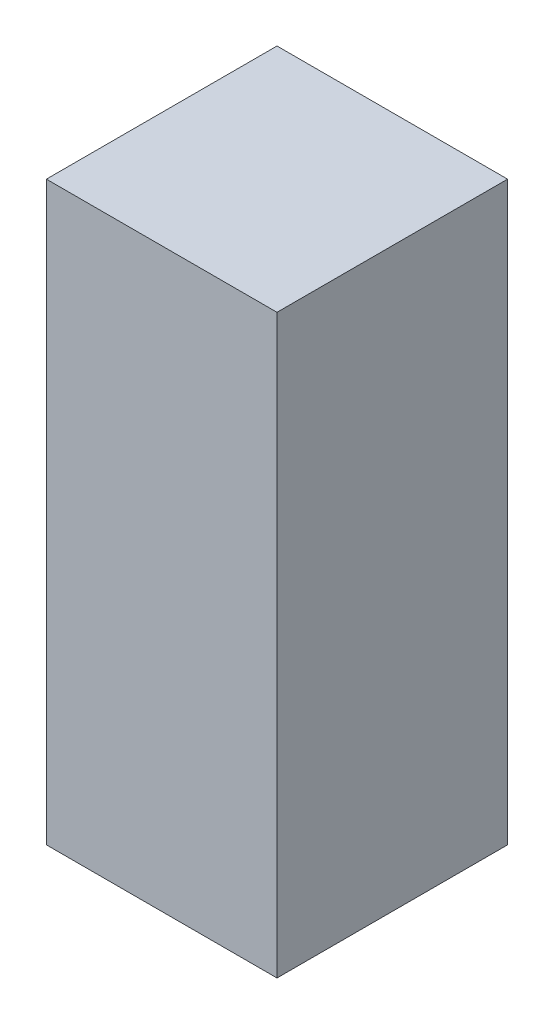
ISO-10303-21;
HEADER;
FILE_DESCRIPTION(('STEP AP214'),'2;1');
FILE_NAME('part.step','',(''),(''),'','','');
FILE_SCHEMA(('AUTOMOTIVE_DESIGN { 1 0 10303 214 1 1 1 1 }'));
ENDSEC;
DATA;
#1=APPLICATION_CONTEXT('core data for automotive mechanical design processes');
#2=APPLICATION_PROTOCOL_DEFINITION('international standard','automotive_design',2000,#1);
#3=PRODUCT_CONTEXT('',#1,'mechanical');
#4=PRODUCT('Part','Part','',(#3));
#5=PRODUCT_RELATED_PRODUCT_CATEGORY('part','',(#4));
#6=PRODUCT_DEFINITION_FORMATION('','',#4);
#7=PRODUCT_DEFINITION_CONTEXT('part definition',#1,'design');
#8=PRODUCT_DEFINITION('design','',#6,#7);
#9=PRODUCT_DEFINITION_SHAPE('','',#8);
#10=(LENGTH_UNIT() NAMED_UNIT(*) SI_UNIT(.MILLI.,.METRE.));
#11=(NAMED_UNIT(*) PLANE_ANGLE_UNIT() SI_UNIT($,.RADIAN.));
#12=(NAMED_UNIT(*) SI_UNIT($,.STERADIAN.) SOLID_ANGLE_UNIT());
#13=UNCERTAINTY_MEASURE_WITH_UNIT(LENGTH_MEASURE(1.E-05),#10,'distance_accuracy_value','');
#14=(GEOMETRIC_REPRESENTATION_CONTEXT(3) GLOBAL_UNCERTAINTY_ASSIGNED_CONTEXT((#13)) GLOBAL_UNIT_ASSIGNED_CONTEXT((#10,
#11,#12)) REPRESENTATION_CONTEXT('',''));
#15=CARTESIAN_POINT('',(0.,0.,0.));
#16=DIRECTION('',(0.,0.,1.));
#17=DIRECTION('',(1.,0.,0.));
#18=AXIS2_PLACEMENT_3D('',#15,#16,#17);
#19=CARTESIAN_POINT('',(0.,50.8,0.));
#20=DIRECTION('',(1.,0.,0.));
#21=DIRECTION('',(0.,0.,-1.));
#22=AXIS2_PLACEMENT_3D('',#19,#20,#21);
#23=PLANE('',#22);
#24=DIRECTION('',(0.,0.,1.));
#25=VECTOR('',#24,1.);
#26=CARTESIAN_POINT('',(0.,0.,0.));
#27=LINE('',#26,#25);
#28=CARTESIAN_POINT('',(0.,0.,-20.32));
#29=VERTEX_POINT('',#28);
#30=CARTESIAN_POINT('',(0.,0.,0.));
#31=VERTEX_POINT('',#30);
#32=EDGE_CURVE('E96',#29,#31,#27,.T.);
#33=ORIENTED_EDGE('',*,*,#32,.T.);
#34=DIRECTION('',(0.,-1.,0.));
#35=VECTOR('',#34,1.);
#36=CARTESIAN_POINT('',(0.,50.8,0.));
#37=LINE('',#36,#35);
#38=CARTESIAN_POINT('',(0.,50.8,0.));
#39=VERTEX_POINT('',#38);
#40=EDGE_CURVE('E11',#39,#31,#37,.T.);
#41=ORIENTED_EDGE('',*,*,#40,.F.);
#42=DIRECTION('',(0.,0.,1.));
#43=VECTOR('',#42,1.);
#44=CARTESIAN_POINT('',(0.,50.8,0.));
#45=LINE('',#44,#43);
#46=CARTESIAN_POINT('',(0.,50.8,-20.32));
#47=VERTEX_POINT('',#46);
#48=EDGE_CURVE('E84',#47,#39,#45,.T.);
#49=ORIENTED_EDGE('',*,*,#48,.F.);
#50=DIRECTION('',(0.,-1.,0.));
#51=VECTOR('',#50,1.);
#52=CARTESIAN_POINT('',(0.,50.8,-20.32));
#53=LINE('',#52,#51);
#54=EDGE_CURVE('E92',#47,#29,#53,.T.);
#55=ORIENTED_EDGE('',*,*,#54,.T.);
#56=EDGE_LOOP('',(#33,#41,#49,#55));
#57=FACE_BOUND('',#56,.T.);
#58=ADVANCED_FACE('F33',(#57),#23,.F.);
#59=CARTESIAN_POINT('',(0.,50.8,0.));
#60=DIRECTION('',(0.,0.,-1.));
#61=DIRECTION('',(-1.,0.,0.));
#62=AXIS2_PLACEMENT_3D('',#59,#60,#61);
#63=PLANE('',#62);
#64=DIRECTION('',(1.,0.,0.));
#65=VECTOR('',#64,1.);
#66=CARTESIAN_POINT('',(0.,0.,0.));
#67=LINE('',#66,#65);
#68=CARTESIAN_POINT('',(20.32,0.,0.));
#69=VERTEX_POINT('',#68);
#70=EDGE_CURVE('E88',#31,#69,#67,.T.);
#71=ORIENTED_EDGE('',*,*,#70,.T.);
#72=DIRECTION('',(0.,-1.,0.));
#73=VECTOR('',#72,1.);
#74=CARTESIAN_POINT('',(20.32,50.8,0.));
#75=LINE('',#74,#73);
#76=CARTESIAN_POINT('',(20.32,50.8,0.));
#77=VERTEX_POINT('',#76);
#78=EDGE_CURVE('E41',#77,#69,#75,.T.);
#79=ORIENTED_EDGE('',*,*,#78,.F.);
#80=DIRECTION('',(1.,0.,0.));
#81=VECTOR('',#80,1.);
#82=CARTESIAN_POINT('',(0.,50.8,0.));
#83=LINE('',#82,#81);
#84=EDGE_CURVE('E79',#39,#77,#83,.T.);
#85=ORIENTED_EDGE('',*,*,#84,.F.);
#86=ORIENTED_EDGE('',*,*,#40,.T.);
#87=EDGE_LOOP('',(#71,#79,#85,#86));
#88=FACE_BOUND('',#87,.T.);
#89=ADVANCED_FACE('F87',(#88),#63,.F.);
#90=CARTESIAN_POINT('',(20.32,50.8,0.));
#91=DIRECTION('',(-1.,0.,0.));
#92=DIRECTION('',(0.,0.,1.));
#93=AXIS2_PLACEMENT_3D('',#90,#91,#92);
#94=PLANE('',#93);
#95=DIRECTION('',(0.,0.,-1.));
#96=VECTOR('',#95,1.);
#97=CARTESIAN_POINT('',(20.32,0.,0.));
#98=LINE('',#97,#96);
#99=CARTESIAN_POINT('',(20.32,0.,-20.32));
#100=VERTEX_POINT('',#99);
#101=EDGE_CURVE('E66',#69,#100,#98,.T.);
#102=ORIENTED_EDGE('',*,*,#101,.T.);
#103=DIRECTION('',(0.,-1.,0.));
#104=VECTOR('',#103,1.);
#105=CARTESIAN_POINT('',(20.32,50.8,-20.32));
#106=LINE('',#105,#104);
#107=CARTESIAN_POINT('',(20.32,50.8,-20.32));
#108=VERTEX_POINT('',#107);
#109=EDGE_CURVE('E89',#108,#100,#106,.T.);
#110=ORIENTED_EDGE('',*,*,#109,.F.);
#111=DIRECTION('',(0.,0.,-1.));
#112=VECTOR('',#111,1.);
#113=CARTESIAN_POINT('',(20.32,50.8,0.));
#114=LINE('',#113,#112);
#115=EDGE_CURVE('E82',#77,#108,#114,.T.);
#116=ORIENTED_EDGE('',*,*,#115,.F.);
#117=ORIENTED_EDGE('',*,*,#78,.T.);
#118=EDGE_LOOP('',(#102,#110,#116,#117));
#119=FACE_BOUND('',#118,.T.);
#120=ADVANCED_FACE('F90',(#119),#94,.F.);
#121=CARTESIAN_POINT('',(0.,50.8,-20.32));
#122=DIRECTION('',(0.,0.,1.));
#123=DIRECTION('',(1.,0.,0.));
#124=AXIS2_PLACEMENT_3D('',#121,#122,#123);
#125=PLANE('',#124);
#126=DIRECTION('',(-1.,0.,0.));
#127=VECTOR('',#126,1.);
#128=CARTESIAN_POINT('',(0.,0.,-20.32));
#129=LINE('',#128,#127);
#130=EDGE_CURVE('E72',#100,#29,#129,.T.);
#131=ORIENTED_EDGE('',*,*,#130,.T.);
#132=ORIENTED_EDGE('',*,*,#54,.F.);
#133=DIRECTION('',(-1.,0.,0.));
#134=VECTOR('',#133,1.);
#135=CARTESIAN_POINT('',(0.,50.8,-20.32));
#136=LINE('',#135,#134);
#137=EDGE_CURVE('E49',#108,#47,#136,.T.);
#138=ORIENTED_EDGE('',*,*,#137,.F.);
#139=ORIENTED_EDGE('',*,*,#109,.T.);
#140=EDGE_LOOP('',(#131,#132,#138,#139));
#141=FACE_BOUND('',#140,.T.);
#142=ADVANCED_FACE('F103',(#141),#125,.F.);
#143=CARTESIAN_POINT('',(0.,50.8,0.));
#144=DIRECTION('',(0.,-1.,0.));
#145=DIRECTION('',(0.,0.,-1.));
#146=AXIS2_PLACEMENT_3D('',#143,#144,#145);
#147=PLANE('',#146);
#148=ORIENTED_EDGE('',*,*,#48,.T.);
#149=ORIENTED_EDGE('',*,*,#84,.T.);
#150=ORIENTED_EDGE('',*,*,#115,.T.);
#151=ORIENTED_EDGE('',*,*,#137,.T.);
#152=EDGE_LOOP('',(#148,#149,#150,#151));
#153=FACE_BOUND('',#152,.T.);
#154=ADVANCED_FACE('F80',(#153),#147,.F.);
#155=CARTESIAN_POINT('',(0.,0.,0.));
#156=DIRECTION('',(0.,-1.,0.));
#157=DIRECTION('',(0.,0.,-1.));
#158=AXIS2_PLACEMENT_3D('',#155,#156,#157);
#159=PLANE('',#158);
#160=ORIENTED_EDGE('',*,*,#32,.F.);
#161=ORIENTED_EDGE('',*,*,#130,.F.);
#162=ORIENTED_EDGE('',*,*,#101,.F.);
#163=ORIENTED_EDGE('',*,*,#70,.F.);
#164=EDGE_LOOP('',(#160,#161,#162,#163));
#165=FACE_BOUND('',#164,.T.);
#166=ADVANCED_FACE('F106',(#165),#159,.T.);
#167=CLOSED_SHELL('',(#58,#89,#120,#142,#154,#166));
#168=MANIFOLD_SOLID_BREP('B2',#167);
#169=ADVANCED_BREP_SHAPE_REPRESENTATION('',(#18,#168),#14);
#170=SHAPE_DEFINITION_REPRESENTATION(#9,#169);
ENDSEC;
END-ISO-10303-21;
